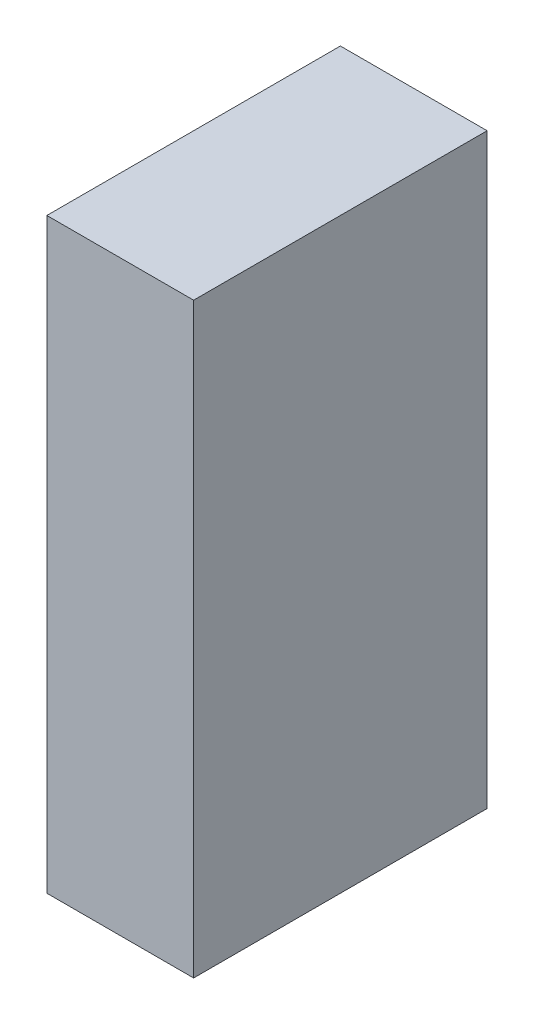
ISO-10303-21;
HEADER;
FILE_DESCRIPTION(('STEP AP214'),'2;1');
FILE_NAME('part.step','',(''),(''),'','','');
FILE_SCHEMA(('AUTOMOTIVE_DESIGN { 1 0 10303 214 1 1 1 1 }'));
ENDSEC;
DATA;
#1=APPLICATION_CONTEXT('core data for automotive mechanical design processes');
#2=APPLICATION_PROTOCOL_DEFINITION('international standard','automotive_design',2000,#1);
#3=PRODUCT_CONTEXT('',#1,'mechanical');
#4=PRODUCT('Part','Part','',(#3));
#5=PRODUCT_RELATED_PRODUCT_CATEGORY('part','',(#4));
#6=PRODUCT_DEFINITION_FORMATION('','',#4);
#7=PRODUCT_DEFINITION_CONTEXT('part definition',#1,'design');
#8=PRODUCT_DEFINITION('design','',#6,#7);
#9=PRODUCT_DEFINITION_SHAPE('','',#8);
#10=(LENGTH_UNIT() NAMED_UNIT(*) SI_UNIT(.MILLI.,.METRE.));
#11=(NAMED_UNIT(*) PLANE_ANGLE_UNIT() SI_UNIT($,.RADIAN.));
#12=(NAMED_UNIT(*) SI_UNIT($,.STERADIAN.) SOLID_ANGLE_UNIT());
#13=UNCERTAINTY_MEASURE_WITH_UNIT(LENGTH_MEASURE(1.E-05),#10,'distance_accuracy_value','');
#14=(GEOMETRIC_REPRESENTATION_CONTEXT(3) GLOBAL_UNCERTAINTY_ASSIGNED_CONTEXT((#13)) GLOBAL_UNIT_ASSIGNED_CONTEXT((#10,
#11,#12)) REPRESENTATION_CONTEXT('',''));
#15=CARTESIAN_POINT('',(0.,0.,0.));
#16=DIRECTION('',(0.,0.,1.));
#17=DIRECTION('',(1.,0.,0.));
#18=AXIS2_PLACEMENT_3D('',#15,#16,#17);
#19=CARTESIAN_POINT('',(12.7,101.6,-25.4));
#20=DIRECTION('',(-1.,0.,0.));
#21=DIRECTION('',(0.,0.,1.));
#22=AXIS2_PLACEMENT_3D('',#19,#20,#21);
#23=PLANE('',#22);
#24=DIRECTION('',(0.,0.,-1.));
#25=VECTOR('',#24,1.);
#26=CARTESIAN_POINT('',(12.7,0.,-25.4));
#27=LINE('',#26,#25);
#28=CARTESIAN_POINT('',(12.7,0.,25.4));
#29=VERTEX_POINT('',#28);
#30=CARTESIAN_POINT('',(12.7,0.,-25.4));
#31=VERTEX_POINT('',#30);
#32=EDGE_CURVE('E97',#29,#31,#27,.T.);
#33=ORIENTED_EDGE('',*,*,#32,.T.);
#34=DIRECTION('',(0.,-1.,0.));
#35=VECTOR('',#34,1.);
#36=CARTESIAN_POINT('',(12.7,101.6,-25.4));
#37=LINE('',#36,#35);
#38=CARTESIAN_POINT('',(12.7,101.6,-25.4));
#39=VERTEX_POINT('',#38);
#40=EDGE_CURVE('E11',#39,#31,#37,.T.);
#41=ORIENTED_EDGE('',*,*,#40,.F.);
#42=DIRECTION('',(0.,0.,-1.));
#43=VECTOR('',#42,1.);
#44=CARTESIAN_POINT('',(12.7,101.6,-25.4));
#45=LINE('',#44,#43);
#46=CARTESIAN_POINT('',(12.7,101.6,25.4));
#47=VERTEX_POINT('',#46);
#48=EDGE_CURVE('E85',#47,#39,#45,.T.);
#49=ORIENTED_EDGE('',*,*,#48,.F.);
#50=DIRECTION('',(0.,-1.,0.));
#51=VECTOR('',#50,1.);
#52=CARTESIAN_POINT('',(12.7,101.6,25.4));
#53=LINE('',#52,#51);
#54=EDGE_CURVE('E93',#47,#29,#53,.T.);
#55=ORIENTED_EDGE('',*,*,#54,.T.);
#56=EDGE_LOOP('',(#33,#41,#49,#55));
#57=FACE_BOUND('',#56,.T.);
#58=ADVANCED_FACE('F34',(#57),#23,.F.);
#59=CARTESIAN_POINT('',(-12.7,101.6,-25.4));
#60=DIRECTION('',(0.,0.,1.));
#61=DIRECTION('',(1.,0.,0.));
#62=AXIS2_PLACEMENT_3D('',#59,#60,#61);
#63=PLANE('',#62);
#64=DIRECTION('',(-1.,0.,0.));
#65=VECTOR('',#64,1.);
#66=CARTESIAN_POINT('',(-12.7,0.,-25.4));
#67=LINE('',#66,#65);
#68=CARTESIAN_POINT('',(-12.7,0.,-25.4));
#69=VERTEX_POINT('',#68);
#70=EDGE_CURVE('E89',#31,#69,#67,.T.);
#71=ORIENTED_EDGE('',*,*,#70,.T.);
#72=DIRECTION('',(0.,-1.,0.));
#73=VECTOR('',#72,1.);
#74=CARTESIAN_POINT('',(-12.7,101.6,-25.4));
#75=LINE('',#74,#73);
#76=CARTESIAN_POINT('',(-12.7,101.6,-25.4));
#77=VERTEX_POINT('',#76);
#78=EDGE_CURVE('E42',#77,#69,#75,.T.);
#79=ORIENTED_EDGE('',*,*,#78,.F.);
#80=DIRECTION('',(-1.,0.,0.));
#81=VECTOR('',#80,1.);
#82=CARTESIAN_POINT('',(-12.7,101.6,-25.4));
#83=LINE('',#82,#81);
#84=EDGE_CURVE('E80',#39,#77,#83,.T.);
#85=ORIENTED_EDGE('',*,*,#84,.F.);
#86=ORIENTED_EDGE('',*,*,#40,.T.);
#87=EDGE_LOOP('',(#71,#79,#85,#86));
#88=FACE_BOUND('',#87,.T.);
#89=ADVANCED_FACE('F88',(#88),#63,.F.);
#90=CARTESIAN_POINT('',(-12.7,101.6,-25.4));
#91=DIRECTION('',(1.,0.,0.));
#92=DIRECTION('',(0.,0.,-1.));
#93=AXIS2_PLACEMENT_3D('',#90,#91,#92);
#94=PLANE('',#93);
#95=DIRECTION('',(0.,0.,1.));
#96=VECTOR('',#95,1.);
#97=CARTESIAN_POINT('',(-12.7,0.,-25.4));
#98=LINE('',#97,#96);
#99=CARTESIAN_POINT('',(-12.7,0.,25.4));
#100=VERTEX_POINT('',#99);
#101=EDGE_CURVE('E67',#69,#100,#98,.T.);
#102=ORIENTED_EDGE('',*,*,#101,.T.);
#103=DIRECTION('',(0.,-1.,0.));
#104=VECTOR('',#103,1.);
#105=CARTESIAN_POINT('',(-12.7,101.6,25.4));
#106=LINE('',#105,#104);
#107=CARTESIAN_POINT('',(-12.7,101.6,25.4));
#108=VERTEX_POINT('',#107);
#109=EDGE_CURVE('E90',#108,#100,#106,.T.);
#110=ORIENTED_EDGE('',*,*,#109,.F.);
#111=DIRECTION('',(0.,0.,1.));
#112=VECTOR('',#111,1.);
#113=CARTESIAN_POINT('',(-12.7,101.6,-25.4));
#114=LINE('',#113,#112);
#115=EDGE_CURVE('E83',#77,#108,#114,.T.);
#116=ORIENTED_EDGE('',*,*,#115,.F.);
#117=ORIENTED_EDGE('',*,*,#78,.T.);
#118=EDGE_LOOP('',(#102,#110,#116,#117));
#119=FACE_BOUND('',#118,.T.);
#120=ADVANCED_FACE('F91',(#119),#94,.F.);
#121=CARTESIAN_POINT('',(-12.7,101.6,25.4));
#122=DIRECTION('',(0.,0.,-1.));
#123=DIRECTION('',(-1.,0.,0.));
#124=AXIS2_PLACEMENT_3D('',#121,#122,#123);
#125=PLANE('',#124);
#126=DIRECTION('',(1.,0.,0.));
#127=VECTOR('',#126,1.);
#128=CARTESIAN_POINT('',(-12.7,0.,25.4));
#129=LINE('',#128,#127);
#130=EDGE_CURVE('E73',#100,#29,#129,.T.);
#131=ORIENTED_EDGE('',*,*,#130,.T.);
#132=ORIENTED_EDGE('',*,*,#54,.F.);
#133=DIRECTION('',(1.,0.,0.));
#134=VECTOR('',#133,1.);
#135=CARTESIAN_POINT('',(-12.7,101.6,25.4));
#136=LINE('',#135,#134);
#137=EDGE_CURVE('E50',#108,#47,#136,.T.);
#138=ORIENTED_EDGE('',*,*,#137,.F.);
#139=ORIENTED_EDGE('',*,*,#109,.T.);
#140=EDGE_LOOP('',(#131,#132,#138,#139));
#141=FACE_BOUND('',#140,.T.);
#142=ADVANCED_FACE('F104',(#141),#125,.F.);
#143=CARTESIAN_POINT('',(0.,101.6,0.));
#144=DIRECTION('',(0.,1.,0.));
#145=DIRECTION('',(0.,0.,1.));
#146=AXIS2_PLACEMENT_3D('',#143,#144,#145);
#147=PLANE('',#146);
#148=ORIENTED_EDGE('',*,*,#48,.T.);
#149=ORIENTED_EDGE('',*,*,#84,.T.);
#150=ORIENTED_EDGE('',*,*,#115,.T.);
#151=ORIENTED_EDGE('',*,*,#137,.T.);
#152=EDGE_LOOP('',(#148,#149,#150,#151));
#153=FACE_BOUND('',#152,.T.);
#154=ADVANCED_FACE('F81',(#153),#147,.T.);
#155=CARTESIAN_POINT('',(0.,0.,0.));
#156=DIRECTION('',(0.,1.,0.));
#157=DIRECTION('',(0.,0.,1.));
#158=AXIS2_PLACEMENT_3D('',#155,#156,#157);
#159=PLANE('',#158);
#160=ORIENTED_EDGE('',*,*,#32,.F.);
#161=ORIENTED_EDGE('',*,*,#130,.F.);
#162=ORIENTED_EDGE('',*,*,#101,.F.);
#163=ORIENTED_EDGE('',*,*,#70,.F.);
#164=EDGE_LOOP('',(#160,#161,#162,#163));
#165=FACE_BOUND('',#164,.T.);
#166=ADVANCED_FACE('F107',(#165),#159,.F.);
#167=CLOSED_SHELL('',(#58,#89,#120,#142,#154,#166));
#168=MANIFOLD_SOLID_BREP('B2',#167);
#169=ADVANCED_BREP_SHAPE_REPRESENTATION('',(#18,#168),#14);
#170=SHAPE_DEFINITION_REPRESENTATION(#9,#169);
ENDSEC;
END-ISO-10303-21;
